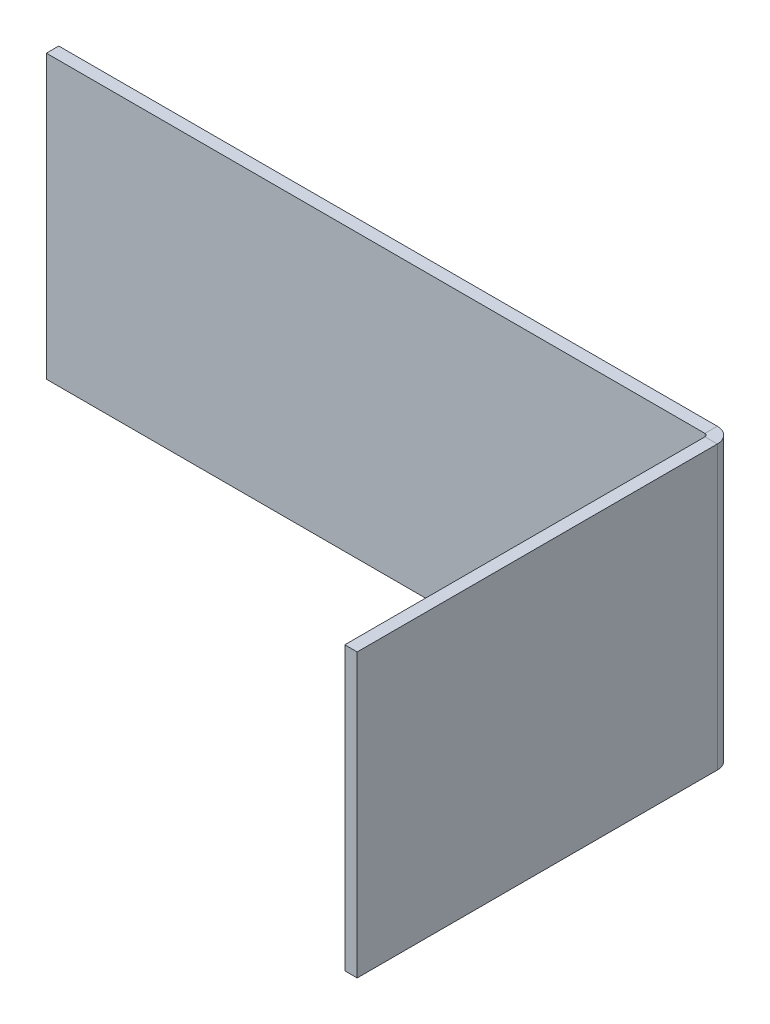
ISO-10303-21;
HEADER;
FILE_DESCRIPTION(('STEP AP214'),'2;1');
FILE_NAME('part.step','',(''),(''),'','','');
FILE_SCHEMA(('AUTOMOTIVE_DESIGN { 1 0 10303 214 1 1 1 1 }'));
ENDSEC;
DATA;
#1=APPLICATION_CONTEXT('core data for automotive mechanical design processes');
#2=APPLICATION_PROTOCOL_DEFINITION('international standard','automotive_design',2000,#1);
#3=PRODUCT_CONTEXT('',#1,'mechanical');
#4=PRODUCT('Part','Part','',(#3));
#5=PRODUCT_RELATED_PRODUCT_CATEGORY('part','',(#4));
#6=PRODUCT_DEFINITION_FORMATION('','',#4);
#7=PRODUCT_DEFINITION_CONTEXT('part definition',#1,'design');
#8=PRODUCT_DEFINITION('design','',#6,#7);
#9=PRODUCT_DEFINITION_SHAPE('','',#8);
#10=(LENGTH_UNIT() NAMED_UNIT(*) SI_UNIT(.MILLI.,.METRE.));
#11=(NAMED_UNIT(*) PLANE_ANGLE_UNIT() SI_UNIT($,.RADIAN.));
#12=(NAMED_UNIT(*) SI_UNIT($,.STERADIAN.) SOLID_ANGLE_UNIT());
#13=UNCERTAINTY_MEASURE_WITH_UNIT(LENGTH_MEASURE(1.E-05),#10,'distance_accuracy_value','');
#14=(GEOMETRIC_REPRESENTATION_CONTEXT(3) GLOBAL_UNCERTAINTY_ASSIGNED_CONTEXT((#13)) GLOBAL_UNIT_ASSIGNED_CONTEXT((#10,
#11,#12)) REPRESENTATION_CONTEXT('',''));
#15=CARTESIAN_POINT('',(0.,0.,0.));
#16=DIRECTION('',(0.,0.,1.));
#17=DIRECTION('',(1.,0.,0.));
#18=AXIS2_PLACEMENT_3D('',#15,#16,#17);
#19=CARTESIAN_POINT('',(-79.7872907524784,-34.2134243458475,-3.));
#20=DIRECTION('',(0.,-1.,0.));
#21=DIRECTION('',(0.,0.,-1.));
#22=AXIS2_PLACEMENT_3D('',#19,#20,#21);
#23=PLANE('',#22);
#24=DIRECTION('',(1.,0.,0.));
#25=VECTOR('',#24,1.);
#26=CARTESIAN_POINT('',(-79.7872907524784,-34.2134243458475,0.));
#27=LINE('',#26,#25);
#28=CARTESIAN_POINT('',(-79.7872907524784,-34.2134243458475,0.));
#29=VERTEX_POINT('',#28);
#30=CARTESIAN_POINT('',(79.7872907524784,-34.2134243458475,0.));
#31=VERTEX_POINT('',#30);
#32=EDGE_CURVE('E195',#29,#31,#27,.T.);
#33=ORIENTED_EDGE('',*,*,#32,.F.);
#34=DIRECTION('',(0.,0.,1.));
#35=VECTOR('',#34,1.);
#36=CARTESIAN_POINT('',(-79.7872907524784,-34.2134243458475,-3.));
#37=LINE('',#36,#35);
#38=CARTESIAN_POINT('',(-79.7872907524784,-34.2134243458475,-3.));
#39=VERTEX_POINT('',#38);
#40=EDGE_CURVE('E75',#39,#29,#37,.T.);
#41=ORIENTED_EDGE('',*,*,#40,.F.);
#42=DIRECTION('',(1.,0.,0.));
#43=VECTOR('',#42,1.);
#44=CARTESIAN_POINT('',(-79.7872907524784,-34.2134243458475,-3.));
#45=LINE('',#44,#43);
#46=CARTESIAN_POINT('',(79.7872907524784,-34.2134243458475,-3.));
#47=VERTEX_POINT('',#46);
#48=EDGE_CURVE('E200',#39,#47,#45,.T.);
#49=ORIENTED_EDGE('',*,*,#48,.T.);
#50=DIRECTION('',(0.,0.,1.));
#51=VECTOR('',#50,1.);
#52=CARTESIAN_POINT('',(79.7872907524784,-34.2134243458475,-3.));
#53=LINE('',#52,#51);
#54=EDGE_CURVE('E13',#47,#31,#53,.T.);
#55=ORIENTED_EDGE('',*,*,#54,.T.);
#56=EDGE_LOOP('',(#33,#41,#49,#55));
#57=FACE_BOUND('',#56,.T.);
#58=ADVANCED_FACE('F65',(#57),#23,.T.);
#59=CARTESIAN_POINT('',(-79.7872907524784,-34.2134243458475,-3.));
#60=DIRECTION('',(-1.,0.,0.));
#61=DIRECTION('',(0.,0.,1.));
#62=AXIS2_PLACEMENT_3D('',#59,#60,#61);
#63=PLANE('',#62);
#64=DIRECTION('',(0.,-1.,0.));
#65=VECTOR('',#64,1.);
#66=CARTESIAN_POINT('',(-79.7872907524784,-34.2134243458475,0.));
#67=LINE('',#66,#65);
#68=CARTESIAN_POINT('',(-79.7872907524784,34.2134243458475,0.));
#69=VERTEX_POINT('',#68);
#70=EDGE_CURVE('E207',#69,#29,#67,.T.);
#71=ORIENTED_EDGE('',*,*,#70,.F.);
#72=DIRECTION('',(0.,0.,1.));
#73=VECTOR('',#72,1.);
#74=CARTESIAN_POINT('',(-79.7872907524784,34.2134243458475,-3.));
#75=LINE('',#74,#73);
#76=CARTESIAN_POINT('',(-79.7872907524784,34.2134243458475,-3.));
#77=VERTEX_POINT('',#76);
#78=EDGE_CURVE('E108',#77,#69,#75,.T.);
#79=ORIENTED_EDGE('',*,*,#78,.F.);
#80=DIRECTION('',(0.,-1.,0.));
#81=VECTOR('',#80,1.);
#82=CARTESIAN_POINT('',(-79.7872907524784,-34.2134243458475,-3.));
#83=LINE('',#82,#81);
#84=EDGE_CURVE('E198',#77,#39,#83,.T.);
#85=ORIENTED_EDGE('',*,*,#84,.T.);
#86=ORIENTED_EDGE('',*,*,#40,.T.);
#87=EDGE_LOOP('',(#71,#79,#85,#86));
#88=FACE_BOUND('',#87,.T.);
#89=ADVANCED_FACE('F245',(#88),#63,.T.);
#90=CARTESIAN_POINT('',(-79.7872907524784,34.2134243458475,-3.));
#91=DIRECTION('',(0.,1.,0.));
#92=DIRECTION('',(0.,0.,1.));
#93=AXIS2_PLACEMENT_3D('',#90,#91,#92);
#94=PLANE('',#93);
#95=DIRECTION('',(-1.,0.,0.));
#96=VECTOR('',#95,1.);
#97=CARTESIAN_POINT('',(-79.7872907524784,34.2134243458475,0.));
#98=LINE('',#97,#96);
#99=CARTESIAN_POINT('',(79.7872907524784,34.2134243458475,0.));
#100=VERTEX_POINT('',#99);
#101=EDGE_CURVE('E204',#100,#69,#98,.T.);
#102=ORIENTED_EDGE('',*,*,#101,.F.);
#103=DIRECTION('',(0.,0.,1.));
#104=VECTOR('',#103,1.);
#105=CARTESIAN_POINT('',(79.7872907524784,34.2134243458475,-3.));
#106=LINE('',#105,#104);
#107=CARTESIAN_POINT('',(79.7872907524784,34.2134243458475,-3.));
#108=VERTEX_POINT('',#107);
#109=EDGE_CURVE('E69',#108,#100,#106,.T.);
#110=ORIENTED_EDGE('',*,*,#109,.F.);
#111=DIRECTION('',(-1.,0.,0.));
#112=VECTOR('',#111,1.);
#113=CARTESIAN_POINT('',(-79.7872907524784,34.2134243458475,-3.));
#114=LINE('',#113,#112);
#115=EDGE_CURVE('E194',#108,#77,#114,.T.);
#116=ORIENTED_EDGE('',*,*,#115,.T.);
#117=ORIENTED_EDGE('',*,*,#78,.T.);
#118=EDGE_LOOP('',(#102,#110,#116,#117));
#119=FACE_BOUND('',#118,.T.);
#120=ADVANCED_FACE('F67',(#119),#94,.T.);
#121=CARTESIAN_POINT('',(0.,0.,-3.));
#122=DIRECTION('',(0.,0.,-1.));
#123=DIRECTION('',(-1.,0.,0.));
#124=AXIS2_PLACEMENT_3D('',#121,#122,#123);
#125=PLANE('',#124);
#126=DIRECTION('',(0.,1.,0.));
#127=VECTOR('',#126,1.);
#128=CARTESIAN_POINT('',(79.7872907524784,-34.2134243458475,-3.));
#129=LINE('',#128,#127);
#130=EDGE_CURVE('E84',#47,#108,#129,.T.);
#131=ORIENTED_EDGE('',*,*,#130,.F.);
#132=ORIENTED_EDGE('',*,*,#48,.F.);
#133=ORIENTED_EDGE('',*,*,#84,.F.);
#134=ORIENTED_EDGE('',*,*,#115,.F.);
#135=EDGE_LOOP('',(#131,#132,#133,#134));
#136=FACE_BOUND('',#135,.T.);
#137=ADVANCED_FACE('F240',(#136),#125,.T.);
#138=CARTESIAN_POINT('',(0.,0.,0.));
#139=DIRECTION('',(0.,0.,-1.));
#140=DIRECTION('',(-1.,0.,0.));
#141=AXIS2_PLACEMENT_3D('',#138,#139,#140);
#142=PLANE('',#141);
#143=DIRECTION('',(0.,1.,0.));
#144=VECTOR('',#143,1.);
#145=CARTESIAN_POINT('',(79.7872907524784,-34.2134243458475,0.));
#146=LINE('',#145,#144);
#147=EDGE_CURVE('E183',#31,#100,#146,.T.);
#148=ORIENTED_EDGE('',*,*,#147,.T.);
#149=ORIENTED_EDGE('',*,*,#101,.T.);
#150=ORIENTED_EDGE('',*,*,#70,.T.);
#151=ORIENTED_EDGE('',*,*,#32,.T.);
#152=EDGE_LOOP('',(#148,#149,#150,#151));
#153=FACE_BOUND('',#152,.T.);
#154=ADVANCED_FACE('F233',(#153),#142,.F.);
#155=CARTESIAN_POINT('',(79.7872907524784,-34.2134243458475,0.736600000000006));
#156=DIRECTION('',(0.,-1.,0.));
#157=DIRECTION('',(0.,0.,-1.));
#158=AXIS2_PLACEMENT_3D('',#155,#156,#157);
#159=PLANE('',#158);
#160=DIRECTION('',(-1.,0.,0.));
#161=VECTOR('',#160,1.);
#162=CARTESIAN_POINT('',(83.5238907524784,-34.2134243458475,0.736599999999993));
#163=LINE('',#162,#161);
#164=CARTESIAN_POINT('',(80.5238907524784,-34.2134243458475,0.736600000000004));
#165=VERTEX_POINT('',#164);
#166=CARTESIAN_POINT('',(83.5238907524784,-34.2134243458475,0.736599999999993));
#167=VERTEX_POINT('',#166);
#168=EDGE_CURVE('E162',#165,#167,#163,.F.);
#169=ORIENTED_EDGE('',*,*,#168,.F.);
#170=CARTESIAN_POINT('',(79.7872907524784,-34.2134243458475,0.736600000000006));
#171=DIRECTION('',(0.,1.,0.));
#172=DIRECTION('',(0.,0.,1.));
#173=AXIS2_PLACEMENT_3D('',#170,#171,#172);
#174=CIRCLE('',#173,0.736600000000004);
#175=EDGE_CURVE('E187',#31,#165,#174,.F.);
#176=ORIENTED_EDGE('',*,*,#175,.F.);
#177=ORIENTED_EDGE('',*,*,#54,.F.);
#178=CARTESIAN_POINT('',(79.7872907524784,-34.2134243458475,0.736600000000006));
#179=DIRECTION('',(0.,1.,0.));
#180=DIRECTION('',(0.,0.,1.));
#181=AXIS2_PLACEMENT_3D('',#178,#179,#180);
#182=CIRCLE('',#181,3.7366);
#183=EDGE_CURVE('E180',#47,#167,#182,.F.);
#184=ORIENTED_EDGE('',*,*,#183,.T.);
#185=EDGE_LOOP('',(#169,#176,#177,#184));
#186=FACE_BOUND('',#185,.T.);
#187=ADVANCED_FACE('F231',(#186),#159,.T.);
#188=CARTESIAN_POINT('',(79.7872907524784,34.2134243458475,0.736600000000006));
#189=DIRECTION('',(0.,-1.,0.));
#190=DIRECTION('',(0.,0.,-1.));
#191=AXIS2_PLACEMENT_3D('',#188,#189,#190);
#192=PLANE('',#191);
#193=CARTESIAN_POINT('',(79.7872907524784,34.2134243458475,0.736600000000006));
#194=DIRECTION('',(0.,1.,0.));
#195=DIRECTION('',(0.,0.,1.));
#196=AXIS2_PLACEMENT_3D('',#193,#194,#195);
#197=CIRCLE('',#196,0.736600000000004);
#198=CARTESIAN_POINT('',(80.5238907524784,34.2134243458475,0.736600000000004));
#199=VERTEX_POINT('',#198);
#200=EDGE_CURVE('E190',#199,#100,#197,.T.);
#201=ORIENTED_EDGE('',*,*,#200,.F.);
#202=DIRECTION('',(-1.,0.,0.));
#203=VECTOR('',#202,1.);
#204=CARTESIAN_POINT('',(80.5238907524784,34.2134243458475,0.736600000000004));
#205=LINE('',#204,#203);
#206=CARTESIAN_POINT('',(83.5238907524784,34.2134243458475,0.736599999999993));
#207=VERTEX_POINT('',#206);
#208=EDGE_CURVE('E174',#199,#207,#205,.F.);
#209=ORIENTED_EDGE('',*,*,#208,.T.);
#210=CARTESIAN_POINT('',(79.7872907524784,34.2134243458475,0.736600000000006));
#211=DIRECTION('',(0.,1.,0.));
#212=DIRECTION('',(0.,0.,1.));
#213=AXIS2_PLACEMENT_3D('',#210,#211,#212);
#214=CIRCLE('',#213,3.7366);
#215=EDGE_CURVE('E184',#207,#108,#214,.T.);
#216=ORIENTED_EDGE('',*,*,#215,.T.);
#217=ORIENTED_EDGE('',*,*,#109,.T.);
#218=EDGE_LOOP('',(#201,#209,#216,#217));
#219=FACE_BOUND('',#218,.T.);
#220=ADVANCED_FACE('F215',(#219),#192,.F.);
#221=CARTESIAN_POINT('',(79.7872907524784,34.2134243458475,0.736600000000006));
#222=DIRECTION('',(0.,1.,0.));
#223=DIRECTION('',(1.,0.,0.));
#224=AXIS2_PLACEMENT_3D('',#221,#222,#223);
#225=CYLINDRICAL_SURFACE('',#224,3.7366);
#226=ORIENTED_EDGE('',*,*,#130,.T.);
#227=ORIENTED_EDGE('',*,*,#215,.F.);
#228=DIRECTION('',(0.,1.,0.));
#229=VECTOR('',#228,1.);
#230=CARTESIAN_POINT('',(83.5238907524784,-34.2134243458475,0.736599999999993));
#231=LINE('',#230,#229);
#232=EDGE_CURVE('E172',#207,#167,#231,.F.);
#233=ORIENTED_EDGE('',*,*,#232,.T.);
#234=ORIENTED_EDGE('',*,*,#183,.F.);
#235=EDGE_LOOP('',(#226,#227,#233,#234));
#236=FACE_BOUND('',#235,.T.);
#237=ADVANCED_FACE('F229',(#236),#225,.T.);
#238=CARTESIAN_POINT('',(79.7872907524784,34.2134243458475,0.736600000000006));
#239=DIRECTION('',(0.,1.,0.));
#240=DIRECTION('',(1.,0.,0.));
#241=AXIS2_PLACEMENT_3D('',#238,#239,#240);
#242=CYLINDRICAL_SURFACE('',#241,0.736600000000004);
#243=ORIENTED_EDGE('',*,*,#147,.F.);
#244=ORIENTED_EDGE('',*,*,#175,.T.);
#245=DIRECTION('',(0.,1.,0.));
#246=VECTOR('',#245,1.);
#247=CARTESIAN_POINT('',(80.5238907524784,-34.2134243458475,0.736600000000004));
#248=LINE('',#247,#246);
#249=EDGE_CURVE('E177',#165,#199,#248,.T.);
#250=ORIENTED_EDGE('',*,*,#249,.T.);
#251=ORIENTED_EDGE('',*,*,#200,.T.);
#252=EDGE_LOOP('',(#243,#244,#250,#251));
#253=FACE_BOUND('',#252,.T.);
#254=ADVANCED_FACE('F219',(#253),#242,.F.);
#255=CARTESIAN_POINT('',(83.5238907524787,34.2134243458475,88.));
#256=DIRECTION('',(0.,-1.,0.));
#257=DIRECTION('',(0.,0.,-1.));
#258=AXIS2_PLACEMENT_3D('',#255,#256,#257);
#259=PLANE('',#258);
#260=ORIENTED_EDGE('',*,*,#208,.F.);
#261=DIRECTION('',(0.,0.,-1.));
#262=VECTOR('',#261,1.);
#263=CARTESIAN_POINT('',(80.5238907524787,34.2134243458475,88.));
#264=LINE('',#263,#262);
#265=CARTESIAN_POINT('',(80.5238907524787,34.2134243458475,88.));
#266=VERTEX_POINT('',#265);
#267=EDGE_CURVE('E170',#199,#266,#264,.F.);
#268=ORIENTED_EDGE('',*,*,#267,.T.);
#269=DIRECTION('',(-1.,0.,0.));
#270=VECTOR('',#269,1.);
#271=CARTESIAN_POINT('',(83.5238907524787,34.2134243458475,88.));
#272=LINE('',#271,#270);
#273=CARTESIAN_POINT('',(83.5238907524787,34.2134243458475,88.));
#274=VERTEX_POINT('',#273);
#275=EDGE_CURVE('E158',#274,#266,#272,.T.);
#276=ORIENTED_EDGE('',*,*,#275,.F.);
#277=DIRECTION('',(0.,0.,1.));
#278=VECTOR('',#277,1.);
#279=CARTESIAN_POINT('',(83.5238907524784,34.2134243458475,-2.87292216722352E-13));
#280=LINE('',#279,#278);
#281=EDGE_CURVE('E145',#207,#274,#280,.T.);
#282=ORIENTED_EDGE('',*,*,#281,.F.);
#283=EDGE_LOOP('',(#260,#268,#276,#282));
#284=FACE_BOUND('',#283,.T.);
#285=ADVANCED_FACE('F226',(#284),#259,.F.);
#286=CARTESIAN_POINT('',(83.5238907524784,-34.2134243458475,0.));
#287=DIRECTION('',(0.,1.,0.));
#288=DIRECTION('',(0.,0.,1.));
#289=AXIS2_PLACEMENT_3D('',#286,#287,#288);
#290=PLANE('',#289);
#291=ORIENTED_EDGE('',*,*,#168,.T.);
#292=DIRECTION('',(0.,0.,-1.));
#293=VECTOR('',#292,1.);
#294=CARTESIAN_POINT('',(83.5238907524784,-34.2134243458475,-2.87292216722352E-13));
#295=LINE('',#294,#293);
#296=CARTESIAN_POINT('',(83.5238907524787,-34.2134243458475,88.));
#297=VERTEX_POINT('',#296);
#298=EDGE_CURVE('E143',#297,#167,#295,.T.);
#299=ORIENTED_EDGE('',*,*,#298,.F.);
#300=DIRECTION('',(-1.,0.,0.));
#301=VECTOR('',#300,1.);
#302=CARTESIAN_POINT('',(83.5238907524787,-34.2134243458475,88.));
#303=LINE('',#302,#301);
#304=CARTESIAN_POINT('',(80.5238907524787,-34.2134243458475,88.));
#305=VERTEX_POINT('',#304);
#306=EDGE_CURVE('E151',#297,#305,#303,.T.);
#307=ORIENTED_EDGE('',*,*,#306,.T.);
#308=DIRECTION('',(0.,0.,1.));
#309=VECTOR('',#308,1.);
#310=CARTESIAN_POINT('',(80.5238907524784,-34.2134243458475,0.));
#311=LINE('',#310,#309);
#312=EDGE_CURVE('E167',#305,#165,#311,.F.);
#313=ORIENTED_EDGE('',*,*,#312,.T.);
#314=EDGE_LOOP('',(#291,#299,#307,#313));
#315=FACE_BOUND('',#314,.T.);
#316=ADVANCED_FACE('F161',(#315),#290,.F.);
#317=CARTESIAN_POINT('',(83.5238907524784,0.,-2.87292216722352E-13));
#318=DIRECTION('',(-1.,0.,0.));
#319=DIRECTION('',(0.,0.,1.));
#320=AXIS2_PLACEMENT_3D('',#317,#318,#319);
#321=PLANE('',#320);
#322=ORIENTED_EDGE('',*,*,#232,.F.);
#323=ORIENTED_EDGE('',*,*,#281,.T.);
#324=DIRECTION('',(0.,-1.,0.));
#325=VECTOR('',#324,1.);
#326=CARTESIAN_POINT('',(83.5238907524787,0.,88.));
#327=LINE('',#326,#325);
#328=EDGE_CURVE('E138',#274,#297,#327,.T.);
#329=ORIENTED_EDGE('',*,*,#328,.T.);
#330=ORIENTED_EDGE('',*,*,#298,.T.);
#331=EDGE_LOOP('',(#322,#323,#329,#330));
#332=FACE_BOUND('',#331,.T.);
#333=ADVANCED_FACE('F141',(#332),#321,.F.);
#334=CARTESIAN_POINT('',(80.5238907524784,0.,-2.76817772705823E-13));
#335=DIRECTION('',(-1.,0.,0.));
#336=DIRECTION('',(0.,0.,1.));
#337=AXIS2_PLACEMENT_3D('',#334,#335,#336);
#338=PLANE('',#337);
#339=ORIENTED_EDGE('',*,*,#267,.F.);
#340=ORIENTED_EDGE('',*,*,#249,.F.);
#341=ORIENTED_EDGE('',*,*,#312,.F.);
#342=DIRECTION('',(0.,1.,0.));
#343=VECTOR('',#342,1.);
#344=CARTESIAN_POINT('',(80.5238907524787,-34.2134243458475,88.));
#345=LINE('',#344,#343);
#346=EDGE_CURVE('E154',#266,#305,#345,.F.);
#347=ORIENTED_EDGE('',*,*,#346,.F.);
#348=EDGE_LOOP('',(#339,#340,#341,#347));
#349=FACE_BOUND('',#348,.T.);
#350=ADVANCED_FACE('F224',(#349),#338,.T.);
#351=CARTESIAN_POINT('',(83.5238907524787,-34.2134243458475,88.));
#352=DIRECTION('',(0.,0.,-1.));
#353=DIRECTION('',(-1.,0.,0.));
#354=AXIS2_PLACEMENT_3D('',#351,#352,#353);
#355=PLANE('',#354);
#356=ORIENTED_EDGE('',*,*,#346,.T.);
#357=ORIENTED_EDGE('',*,*,#306,.F.);
#358=ORIENTED_EDGE('',*,*,#328,.F.);
#359=ORIENTED_EDGE('',*,*,#275,.T.);
#360=EDGE_LOOP('',(#356,#357,#358,#359));
#361=FACE_BOUND('',#360,.T.);
#362=ADVANCED_FACE('F152',(#361),#355,.F.);
#363=CLOSED_SHELL('',(#58,#89,#120,#137,#154,#187,#220,#237,#254,#285,#316,#333,#350,#362));
#364=MANIFOLD_SOLID_BREP('B2',#363);
#365=ADVANCED_BREP_SHAPE_REPRESENTATION('',(#18,#364),#14);
#366=SHAPE_DEFINITION_REPRESENTATION(#9,#365);
ENDSEC;
END-ISO-10303-21;
